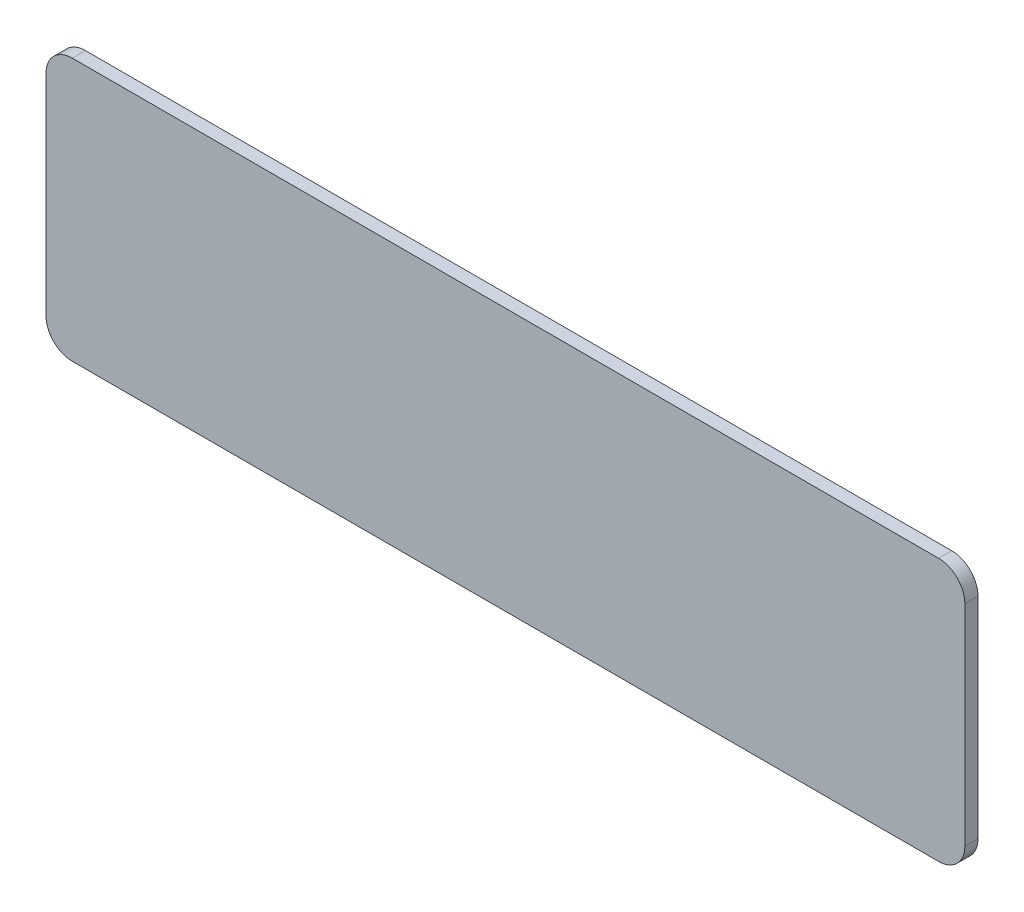
ISO-10303-21;
HEADER;
FILE_DESCRIPTION(('STEP AP214'),'2;1');
FILE_NAME('part.step','',(''),(''),'','','');
FILE_SCHEMA(('AUTOMOTIVE_DESIGN { 1 0 10303 214 1 1 1 1 }'));
ENDSEC;
DATA;
#1=APPLICATION_CONTEXT('core data for automotive mechanical design processes');
#2=APPLICATION_PROTOCOL_DEFINITION('international standard','automotive_design',2000,#1);
#3=PRODUCT_CONTEXT('',#1,'mechanical');
#4=PRODUCT('Part','Part','',(#3));
#5=PRODUCT_RELATED_PRODUCT_CATEGORY('part','',(#4));
#6=PRODUCT_DEFINITION_FORMATION('','',#4);
#7=PRODUCT_DEFINITION_CONTEXT('part definition',#1,'design');
#8=PRODUCT_DEFINITION('design','',#6,#7);
#9=PRODUCT_DEFINITION_SHAPE('','',#8);
#10=(LENGTH_UNIT() NAMED_UNIT(*) SI_UNIT(.MILLI.,.METRE.));
#11=(NAMED_UNIT(*) PLANE_ANGLE_UNIT() SI_UNIT($,.RADIAN.));
#12=(NAMED_UNIT(*) SI_UNIT($,.STERADIAN.) SOLID_ANGLE_UNIT());
#13=UNCERTAINTY_MEASURE_WITH_UNIT(LENGTH_MEASURE(1.E-05),#10,'distance_accuracy_value','');
#14=(GEOMETRIC_REPRESENTATION_CONTEXT(3) GLOBAL_UNCERTAINTY_ASSIGNED_CONTEXT((#13)) GLOBAL_UNIT_ASSIGNED_CONTEXT((#10,
#11,#12)) REPRESENTATION_CONTEXT('',''));
#15=CARTESIAN_POINT('',(0.,0.,0.));
#16=DIRECTION('',(0.,0.,1.));
#17=DIRECTION('',(1.,0.,0.));
#18=AXIS2_PLACEMENT_3D('',#15,#16,#17);
#19=CARTESIAN_POINT('',(-65.87,-40.,-5.));
#20=DIRECTION('',(0.,0.,1.));
#21=DIRECTION('',(1.,0.,0.));
#22=AXIS2_PLACEMENT_3D('',#19,#20,#21);
#23=CYLINDRICAL_SURFACE('',#22,9.99999999999999);
#24=CARTESIAN_POINT('',(-65.87,-40.,0.));
#25=DIRECTION('',(0.,0.,-1.));
#26=DIRECTION('',(-1.,0.,0.));
#27=AXIS2_PLACEMENT_3D('',#24,#25,#26);
#28=CIRCLE('',#27,9.99999999999999);
#29=CARTESIAN_POINT('',(-65.87,-50.,0.));
#30=VERTEX_POINT('',#29);
#31=CARTESIAN_POINT('',(-75.87,-39.9999999999999,0.));
#32=VERTEX_POINT('',#31);
#33=EDGE_CURVE('E129',#30,#32,#28,.T.);
#34=ORIENTED_EDGE('',*,*,#33,.T.);
#35=DIRECTION('',(0.,0.,1.));
#36=VECTOR('',#35,1.);
#37=CARTESIAN_POINT('',(-75.87,-39.9999999999999,-5.));
#38=LINE('',#37,#36);
#39=CARTESIAN_POINT('',(-75.87,-39.9999999999999,-5.));
#40=VERTEX_POINT('',#39);
#41=EDGE_CURVE('E11',#40,#32,#38,.T.);
#42=ORIENTED_EDGE('',*,*,#41,.F.);
#43=CARTESIAN_POINT('',(-65.87,-40.,-5.));
#44=DIRECTION('',(0.,0.,-1.));
#45=DIRECTION('',(-1.,0.,0.));
#46=AXIS2_PLACEMENT_3D('',#43,#44,#45);
#47=CIRCLE('',#46,9.99999999999999);
#48=CARTESIAN_POINT('',(-65.87,-50.,-5.));
#49=VERTEX_POINT('',#48);
#50=EDGE_CURVE('E146',#49,#40,#47,.T.);
#51=ORIENTED_EDGE('',*,*,#50,.F.);
#52=DIRECTION('',(0.,0.,1.));
#53=VECTOR('',#52,1.);
#54=CARTESIAN_POINT('',(-65.87,-50.,-5.));
#55=LINE('',#54,#53);
#56=EDGE_CURVE('E49',#49,#30,#55,.T.);
#57=ORIENTED_EDGE('',*,*,#56,.T.);
#58=EDGE_LOOP('',(#34,#42,#51,#57));
#59=FACE_BOUND('',#58,.T.);
#60=ADVANCED_FACE('F33',(#59),#23,.T.);
#61=CARTESIAN_POINT('',(-75.87,-39.9999999999999,-5.));
#62=DIRECTION('',(1.,0.,0.));
#63=DIRECTION('',(0.,0.,-1.));
#64=AXIS2_PLACEMENT_3D('',#61,#62,#63);
#65=PLANE('',#64);
#66=DIRECTION('',(0.,1.,0.));
#67=VECTOR('',#66,1.);
#68=CARTESIAN_POINT('',(-75.87,-39.9999999999999,0.));
#69=LINE('',#68,#67);
#70=CARTESIAN_POINT('',(-75.87,39.9999999999999,0.));
#71=VERTEX_POINT('',#70);
#72=EDGE_CURVE('E131',#32,#71,#69,.T.);
#73=ORIENTED_EDGE('',*,*,#72,.T.);
#74=DIRECTION('',(0.,0.,1.));
#75=VECTOR('',#74,1.);
#76=CARTESIAN_POINT('',(-75.87,39.9999999999999,-5.));
#77=LINE('',#76,#75);
#78=CARTESIAN_POINT('',(-75.87,39.9999999999999,-5.));
#79=VERTEX_POINT('',#78);
#80=EDGE_CURVE('E41',#79,#71,#77,.T.);
#81=ORIENTED_EDGE('',*,*,#80,.F.);
#82=DIRECTION('',(0.,1.,0.));
#83=VECTOR('',#82,1.);
#84=CARTESIAN_POINT('',(-75.87,-39.9999999999999,-5.));
#85=LINE('',#84,#83);
#86=EDGE_CURVE('E87',#40,#79,#85,.T.);
#87=ORIENTED_EDGE('',*,*,#86,.F.);
#88=ORIENTED_EDGE('',*,*,#41,.T.);
#89=EDGE_LOOP('',(#73,#81,#87,#88));
#90=FACE_BOUND('',#89,.T.);
#91=ADVANCED_FACE('F178',(#90),#65,.F.);
#92=CARTESIAN_POINT('',(-65.87,40.,-5.));
#93=DIRECTION('',(0.,0.,1.));
#94=DIRECTION('',(1.,0.,0.));
#95=AXIS2_PLACEMENT_3D('',#92,#93,#94);
#96=CYLINDRICAL_SURFACE('',#95,9.99999999999999);
#97=CARTESIAN_POINT('',(-65.87,40.,0.));
#98=DIRECTION('',(0.,0.,-1.));
#99=DIRECTION('',(-1.,0.,0.));
#100=AXIS2_PLACEMENT_3D('',#97,#98,#99);
#101=CIRCLE('',#100,9.99999999999999);
#102=CARTESIAN_POINT('',(-65.87,50.,0.));
#103=VERTEX_POINT('',#102);
#104=EDGE_CURVE('E133',#71,#103,#101,.T.);
#105=ORIENTED_EDGE('',*,*,#104,.T.);
#106=DIRECTION('',(0.,0.,1.));
#107=VECTOR('',#106,1.);
#108=CARTESIAN_POINT('',(-65.87,50.,-5.));
#109=LINE('',#108,#107);
#110=CARTESIAN_POINT('',(-65.87,50.,-5.));
#111=VERTEX_POINT('',#110);
#112=EDGE_CURVE('E153',#111,#103,#109,.T.);
#113=ORIENTED_EDGE('',*,*,#112,.F.);
#114=CARTESIAN_POINT('',(-65.87,40.,-5.));
#115=DIRECTION('',(0.,0.,-1.));
#116=DIRECTION('',(-1.,0.,0.));
#117=AXIS2_PLACEMENT_3D('',#114,#115,#116);
#118=CIRCLE('',#117,9.99999999999999);
#119=EDGE_CURVE('E161',#79,#111,#118,.T.);
#120=ORIENTED_EDGE('',*,*,#119,.F.);
#121=ORIENTED_EDGE('',*,*,#80,.T.);
#122=EDGE_LOOP('',(#105,#113,#120,#121));
#123=FACE_BOUND('',#122,.T.);
#124=ADVANCED_FACE('F159',(#123),#96,.T.);
#125=CARTESIAN_POINT('',(-65.87,50.,-5.));
#126=DIRECTION('',(0.,-1.,0.));
#127=DIRECTION('',(0.,0.,-1.));
#128=AXIS2_PLACEMENT_3D('',#125,#126,#127);
#129=PLANE('',#128);
#130=DIRECTION('',(1.,0.,0.));
#131=VECTOR('',#130,1.);
#132=CARTESIAN_POINT('',(-65.87,50.,0.));
#133=LINE('',#132,#131);
#134=CARTESIAN_POINT('',(264.13,50.,0.));
#135=VERTEX_POINT('',#134);
#136=EDGE_CURVE('E135',#103,#135,#133,.T.);
#137=ORIENTED_EDGE('',*,*,#136,.T.);
#138=DIRECTION('',(0.,0.,1.));
#139=VECTOR('',#138,1.);
#140=CARTESIAN_POINT('',(264.13,50.,-5.));
#141=LINE('',#140,#139);
#142=CARTESIAN_POINT('',(264.13,50.,-5.));
#143=VERTEX_POINT('',#142);
#144=EDGE_CURVE('E150',#143,#135,#141,.T.);
#145=ORIENTED_EDGE('',*,*,#144,.F.);
#146=DIRECTION('',(1.,0.,0.));
#147=VECTOR('',#146,1.);
#148=CARTESIAN_POINT('',(-65.87,50.,-5.));
#149=LINE('',#148,#147);
#150=EDGE_CURVE('E172',#111,#143,#149,.T.);
#151=ORIENTED_EDGE('',*,*,#150,.F.);
#152=ORIENTED_EDGE('',*,*,#112,.T.);
#153=EDGE_LOOP('',(#137,#145,#151,#152));
#154=FACE_BOUND('',#153,.T.);
#155=ADVANCED_FACE('F168',(#154),#129,.F.);
#156=CARTESIAN_POINT('',(264.13,40.,-5.));
#157=DIRECTION('',(0.,0.,1.));
#158=DIRECTION('',(1.,0.,0.));
#159=AXIS2_PLACEMENT_3D('',#156,#157,#158);
#160=CYLINDRICAL_SURFACE('',#159,10.);
#161=CARTESIAN_POINT('',(264.13,40.,0.));
#162=DIRECTION('',(0.,0.,-1.));
#163=DIRECTION('',(-1.,0.,0.));
#164=AXIS2_PLACEMENT_3D('',#161,#162,#163);
#165=CIRCLE('',#164,10.);
#166=CARTESIAN_POINT('',(274.13,39.9999999999999,0.));
#167=VERTEX_POINT('',#166);
#168=EDGE_CURVE('E137',#135,#167,#165,.T.);
#169=ORIENTED_EDGE('',*,*,#168,.T.);
#170=DIRECTION('',(0.,0.,1.));
#171=VECTOR('',#170,1.);
#172=CARTESIAN_POINT('',(274.13,39.9999999999999,-5.));
#173=LINE('',#172,#171);
#174=CARTESIAN_POINT('',(274.13,39.9999999999999,-5.));
#175=VERTEX_POINT('',#174);
#176=EDGE_CURVE('E112',#175,#167,#173,.T.);
#177=ORIENTED_EDGE('',*,*,#176,.F.);
#178=CARTESIAN_POINT('',(264.13,40.,-5.));
#179=DIRECTION('',(0.,0.,-1.));
#180=DIRECTION('',(-1.,0.,0.));
#181=AXIS2_PLACEMENT_3D('',#178,#179,#180);
#182=CIRCLE('',#181,10.);
#183=EDGE_CURVE('E120',#143,#175,#182,.T.);
#184=ORIENTED_EDGE('',*,*,#183,.F.);
#185=ORIENTED_EDGE('',*,*,#144,.T.);
#186=EDGE_LOOP('',(#169,#177,#184,#185));
#187=FACE_BOUND('',#186,.T.);
#188=ADVANCED_FACE('F171',(#187),#160,.T.);
#189=CARTESIAN_POINT('',(274.13,-39.9999999999999,-5.));
#190=DIRECTION('',(1.,0.,0.));
#191=DIRECTION('',(0.,0.,-1.));
#192=AXIS2_PLACEMENT_3D('',#189,#190,#191);
#193=PLANE('',#192);
#194=DIRECTION('',(0.,1.,0.));
#195=VECTOR('',#194,1.);
#196=CARTESIAN_POINT('',(274.13,-39.9999999999999,0.));
#197=LINE('',#196,#195);
#198=CARTESIAN_POINT('',(274.13,-39.9999999999999,0.));
#199=VERTEX_POINT('',#198);
#200=EDGE_CURVE('E108',#199,#167,#197,.T.);
#201=ORIENTED_EDGE('',*,*,#200,.F.);
#202=DIRECTION('',(0.,0.,1.));
#203=VECTOR('',#202,1.);
#204=CARTESIAN_POINT('',(274.13,-39.9999999999999,-5.));
#205=LINE('',#204,#203);
#206=CARTESIAN_POINT('',(274.13,-39.9999999999999,-5.));
#207=VERTEX_POINT('',#206);
#208=EDGE_CURVE('E103',#207,#199,#205,.T.);
#209=ORIENTED_EDGE('',*,*,#208,.F.);
#210=DIRECTION('',(0.,1.,0.));
#211=VECTOR('',#210,1.);
#212=CARTESIAN_POINT('',(274.13,-39.9999999999999,-5.));
#213=LINE('',#212,#211);
#214=EDGE_CURVE('E106',#207,#175,#213,.T.);
#215=ORIENTED_EDGE('',*,*,#214,.T.);
#216=ORIENTED_EDGE('',*,*,#176,.T.);
#217=EDGE_LOOP('',(#201,#209,#215,#216));
#218=FACE_BOUND('',#217,.T.);
#219=ADVANCED_FACE('F105',(#218),#193,.T.);
#220=CARTESIAN_POINT('',(264.13,-40.,-5.));
#221=DIRECTION('',(0.,0.,1.));
#222=DIRECTION('',(1.,0.,0.));
#223=AXIS2_PLACEMENT_3D('',#220,#221,#222);
#224=CYLINDRICAL_SURFACE('',#223,10.);
#225=CARTESIAN_POINT('',(264.13,-40.,0.));
#226=DIRECTION('',(0.,0.,1.));
#227=DIRECTION('',(1.,0.,0.));
#228=AXIS2_PLACEMENT_3D('',#225,#226,#227);
#229=CIRCLE('',#228,10.);
#230=CARTESIAN_POINT('',(264.13,-50.,0.));
#231=VERTEX_POINT('',#230);
#232=EDGE_CURVE('E141',#231,#199,#229,.T.);
#233=ORIENTED_EDGE('',*,*,#232,.F.);
#234=DIRECTION('',(0.,0.,1.));
#235=VECTOR('',#234,1.);
#236=CARTESIAN_POINT('',(264.13,-50.,-5.));
#237=LINE('',#236,#235);
#238=CARTESIAN_POINT('',(264.13,-50.,-5.));
#239=VERTEX_POINT('',#238);
#240=EDGE_CURVE('E75',#239,#231,#237,.T.);
#241=ORIENTED_EDGE('',*,*,#240,.F.);
#242=CARTESIAN_POINT('',(264.13,-40.,-5.));
#243=DIRECTION('',(0.,0.,1.));
#244=DIRECTION('',(1.,0.,0.));
#245=AXIS2_PLACEMENT_3D('',#242,#243,#244);
#246=CIRCLE('',#245,10.);
#247=EDGE_CURVE('E118',#239,#207,#246,.T.);
#248=ORIENTED_EDGE('',*,*,#247,.T.);
#249=ORIENTED_EDGE('',*,*,#208,.T.);
#250=EDGE_LOOP('',(#233,#241,#248,#249));
#251=FACE_BOUND('',#250,.T.);
#252=ADVANCED_FACE('F123',(#251),#224,.T.);
#253=CARTESIAN_POINT('',(-65.87,-50.,-5.));
#254=DIRECTION('',(0.,-1.,0.));
#255=DIRECTION('',(0.,0.,-1.));
#256=AXIS2_PLACEMENT_3D('',#253,#254,#255);
#257=PLANE('',#256);
#258=DIRECTION('',(1.,0.,0.));
#259=VECTOR('',#258,1.);
#260=CARTESIAN_POINT('',(-65.87,-50.,0.));
#261=LINE('',#260,#259);
#262=EDGE_CURVE('E143',#30,#231,#261,.T.);
#263=ORIENTED_EDGE('',*,*,#262,.F.);
#264=ORIENTED_EDGE('',*,*,#56,.F.);
#265=DIRECTION('',(1.,0.,0.));
#266=VECTOR('',#265,1.);
#267=CARTESIAN_POINT('',(-65.87,-50.,-5.));
#268=LINE('',#267,#266);
#269=EDGE_CURVE('E124',#49,#239,#268,.T.);
#270=ORIENTED_EDGE('',*,*,#269,.T.);
#271=ORIENTED_EDGE('',*,*,#240,.T.);
#272=EDGE_LOOP('',(#263,#264,#270,#271));
#273=FACE_BOUND('',#272,.T.);
#274=ADVANCED_FACE('F194',(#273),#257,.T.);
#275=CARTESIAN_POINT('',(-65.87,-40.,-5.));
#276=DIRECTION('',(0.,0.,-1.));
#277=DIRECTION('',(-1.,0.,0.));
#278=AXIS2_PLACEMENT_3D('',#275,#276,#277);
#279=PLANE('',#278);
#280=ORIENTED_EDGE('',*,*,#50,.T.);
#281=ORIENTED_EDGE('',*,*,#86,.T.);
#282=ORIENTED_EDGE('',*,*,#119,.T.);
#283=ORIENTED_EDGE('',*,*,#150,.T.);
#284=ORIENTED_EDGE('',*,*,#183,.T.);
#285=ORIENTED_EDGE('',*,*,#214,.F.);
#286=ORIENTED_EDGE('',*,*,#247,.F.);
#287=ORIENTED_EDGE('',*,*,#269,.F.);
#288=EDGE_LOOP('',(#280,#281,#282,#283,#284,#285,#286,#287));
#289=FACE_BOUND('',#288,.T.);
#290=ADVANCED_FACE('F116',(#289),#279,.T.);
#291=CARTESIAN_POINT('',(-65.87,-40.,0.));
#292=DIRECTION('',(0.,0.,-1.));
#293=DIRECTION('',(-1.,0.,0.));
#294=AXIS2_PLACEMENT_3D('',#291,#292,#293);
#295=PLANE('',#294);
#296=ORIENTED_EDGE('',*,*,#33,.F.);
#297=ORIENTED_EDGE('',*,*,#262,.T.);
#298=ORIENTED_EDGE('',*,*,#232,.T.);
#299=ORIENTED_EDGE('',*,*,#200,.T.);
#300=ORIENTED_EDGE('',*,*,#168,.F.);
#301=ORIENTED_EDGE('',*,*,#136,.F.);
#302=ORIENTED_EDGE('',*,*,#104,.F.);
#303=ORIENTED_EDGE('',*,*,#72,.F.);
#304=EDGE_LOOP('',(#296,#297,#298,#299,#300,#301,#302,#303));
#305=FACE_BOUND('',#304,.T.);
#306=ADVANCED_FACE('F164',(#305),#295,.F.);
#307=CLOSED_SHELL('',(#60,#91,#124,#155,#188,#219,#252,#274,#290,#306));
#308=MANIFOLD_SOLID_BREP('B2',#307);
#309=ADVANCED_BREP_SHAPE_REPRESENTATION('',(#18,#308),#14);
#310=SHAPE_DEFINITION_REPRESENTATION(#9,#309);
ENDSEC;
END-ISO-10303-21;
